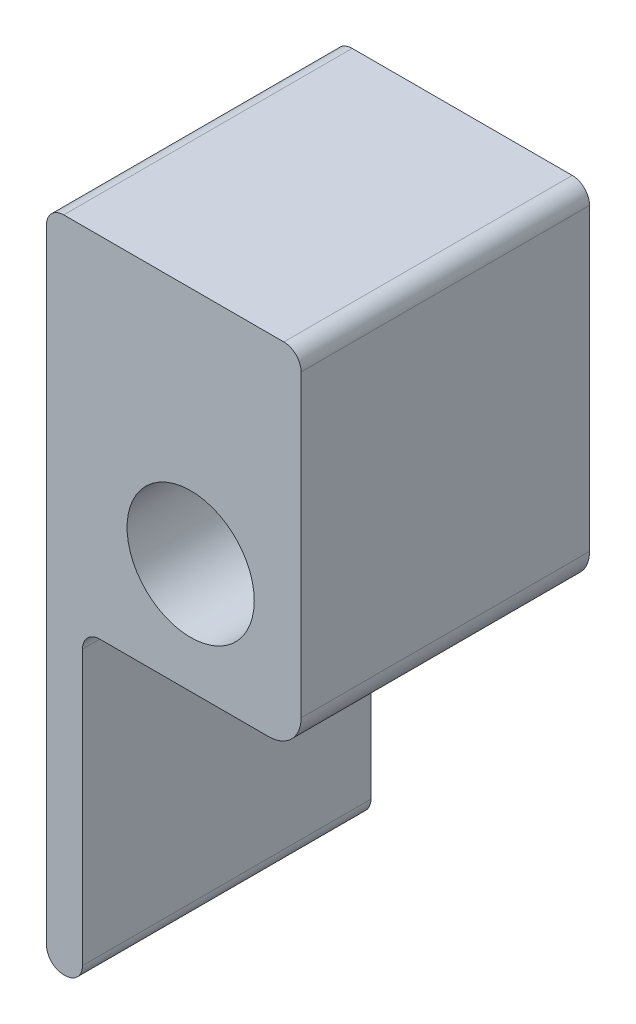
ISO-10303-21;
HEADER;
FILE_DESCRIPTION(('STEP AP214'),'2;1');
FILE_NAME('part.step','',(''),(''),'','','');
FILE_SCHEMA(('AUTOMOTIVE_DESIGN { 1 0 10303 214 1 1 1 1 }'));
ENDSEC;
DATA;
#1=APPLICATION_CONTEXT('core data for automotive mechanical design processes');
#2=APPLICATION_PROTOCOL_DEFINITION('international standard','automotive_design',2000,#1);
#3=PRODUCT_CONTEXT('',#1,'mechanical');
#4=PRODUCT('Part','Part','',(#3));
#5=PRODUCT_RELATED_PRODUCT_CATEGORY('part','',(#4));
#6=PRODUCT_DEFINITION_FORMATION('','',#4);
#7=PRODUCT_DEFINITION_CONTEXT('part definition',#1,'design');
#8=PRODUCT_DEFINITION('design','',#6,#7);
#9=PRODUCT_DEFINITION_SHAPE('','',#8);
#10=(LENGTH_UNIT() NAMED_UNIT(*) SI_UNIT(.MILLI.,.METRE.));
#11=(NAMED_UNIT(*) PLANE_ANGLE_UNIT() SI_UNIT($,.RADIAN.));
#12=(NAMED_UNIT(*) SI_UNIT($,.STERADIAN.) SOLID_ANGLE_UNIT());
#13=UNCERTAINTY_MEASURE_WITH_UNIT(LENGTH_MEASURE(1.E-05),#10,'distance_accuracy_value','');
#14=(GEOMETRIC_REPRESENTATION_CONTEXT(3) GLOBAL_UNCERTAINTY_ASSIGNED_CONTEXT((#13)) GLOBAL_UNIT_ASSIGNED_CONTEXT((#10,
#11,#12)) REPRESENTATION_CONTEXT('',''));
#15=CARTESIAN_POINT('',(0.,0.,0.));
#16=DIRECTION('',(0.,0.,1.));
#17=DIRECTION('',(1.,0.,0.));
#18=AXIS2_PLACEMENT_3D('',#15,#16,#17);
#19=CARTESIAN_POINT('',(-22.352,-70.781999962,50.8));
#20=DIRECTION('',(0.,0.,1.));
#21=DIRECTION('',(1.,0.,0.));
#22=AXIS2_PLACEMENT_3D('',#19,#20,#21);
#23=PLANE('',#22);
#24=DIRECTION('',(0.,-1.,0.));
#25=VECTOR('',#24,1.);
#26=CARTESIAN_POINT('',(-25.4,-19.455,50.8));
#27=LINE('',#26,#25);
#28=CARTESIAN_POINT('',(-25.4,39.031999962,50.8));
#29=VERTEX_POINT('',#28);
#30=CARTESIAN_POINT('',(-25.4,-70.781999962,50.8));
#31=VERTEX_POINT('',#30);
#32=EDGE_CURVE('E63',#29,#31,#27,.T.);
#33=ORIENTED_EDGE('',*,*,#32,.T.);
#34=CARTESIAN_POINT('',(-22.352,-70.781999962,50.8));
#35=DIRECTION('',(0.,0.,1.));
#36=DIRECTION('',(1.,0.,0.));
#37=AXIS2_PLACEMENT_3D('',#34,#35,#36);
#38=CIRCLE('',#37,3.048);
#39=CARTESIAN_POINT('',(-22.352,-73.829999962,50.8));
#40=VERTEX_POINT('',#39);
#41=EDGE_CURVE('E120',#31,#40,#38,.T.);
#42=ORIENTED_EDGE('',*,*,#41,.T.);
#43=DIRECTION('',(1.,0.,0.));
#44=VECTOR('',#43,1.);
#45=CARTESIAN_POINT('',(-22.352,-73.829999962,50.8));
#46=LINE('',#45,#44);
#47=CARTESIAN_POINT('',(-22.098,-73.829999962,50.8));
#48=VERTEX_POINT('',#47);
#49=EDGE_CURVE('E248',#40,#48,#46,.T.);
#50=ORIENTED_EDGE('',*,*,#49,.T.);
#51=CARTESIAN_POINT('',(-22.098,-70.781999962,50.8));
#52=DIRECTION('',(0.,0.,1.));
#53=DIRECTION('',(1.,0.,0.));
#54=AXIS2_PLACEMENT_3D('',#51,#52,#53);
#55=CIRCLE('',#54,3.048);
#56=CARTESIAN_POINT('',(-19.05,-70.781999962,50.8));
#57=VERTEX_POINT('',#56);
#58=EDGE_CURVE('E266',#48,#57,#55,.T.);
#59=ORIENTED_EDGE('',*,*,#58,.T.);
#60=DIRECTION('',(0.,1.,0.));
#61=VECTOR('',#60,1.);
#62=CARTESIAN_POINT('',(-19.05,-22.503,50.8));
#63=LINE('',#62,#61);
#64=CARTESIAN_POINT('',(-19.05,-22.503,50.8));
#65=VERTEX_POINT('',#64);
#66=EDGE_CURVE('E262',#57,#65,#63,.T.);
#67=ORIENTED_EDGE('',*,*,#66,.T.);
#68=CARTESIAN_POINT('',(-16.002,-22.503,50.8));
#69=DIRECTION('',(0.,0.,-1.));
#70=DIRECTION('',(1.,0.,0.));
#71=AXIS2_PLACEMENT_3D('',#68,#69,#70);
#72=CIRCLE('',#71,3.048);
#73=CARTESIAN_POINT('',(-16.002,-19.455,50.8));
#74=VERTEX_POINT('',#73);
#75=EDGE_CURVE('E265',#65,#74,#72,.T.);
#76=ORIENTED_EDGE('',*,*,#75,.T.);
#77=DIRECTION('',(1.,0.,0.));
#78=VECTOR('',#77,1.);
#79=CARTESIAN_POINT('',(-16.002,-19.455,50.8));
#80=LINE('',#79,#78);
#81=CARTESIAN_POINT('',(13.74,-19.455,50.8));
#82=VERTEX_POINT('',#81);
#83=EDGE_CURVE('E270',#74,#82,#80,.T.);
#84=ORIENTED_EDGE('',*,*,#83,.T.);
#85=CARTESIAN_POINT('',(13.74,-13.74,50.8));
#86=DIRECTION('',(0.,0.,1.));
#87=DIRECTION('',(-1.,0.,0.));
#88=AXIS2_PLACEMENT_3D('',#85,#86,#87);
#89=CIRCLE('',#88,5.715);
#90=CARTESIAN_POINT('',(19.455,-13.74,50.8));
#91=VERTEX_POINT('',#90);
#92=EDGE_CURVE('E277',#82,#91,#89,.T.);
#93=ORIENTED_EDGE('',*,*,#92,.T.);
#94=DIRECTION('',(0.,1.,0.));
#95=VECTOR('',#94,1.);
#96=CARTESIAN_POINT('',(19.455,0.,50.8));
#97=LINE('',#96,#95);
#98=CARTESIAN_POINT('',(19.455,39.031999962,50.8));
#99=VERTEX_POINT('',#98);
#100=EDGE_CURVE('E152',#91,#99,#97,.T.);
#101=ORIENTED_EDGE('',*,*,#100,.T.);
#102=CARTESIAN_POINT('',(16.407,39.031999962,50.8));
#103=DIRECTION('',(0.,0.,1.));
#104=DIRECTION('',(-1.,0.,0.));
#105=AXIS2_PLACEMENT_3D('',#102,#103,#104);
#106=CIRCLE('',#105,3.048);
#107=CARTESIAN_POINT('',(16.407,42.079999962,50.8));
#108=VERTEX_POINT('',#107);
#109=EDGE_CURVE('E146',#99,#108,#106,.T.);
#110=ORIENTED_EDGE('',*,*,#109,.T.);
#111=DIRECTION('',(-1.,0.,0.));
#112=VECTOR('',#111,1.);
#113=CARTESIAN_POINT('',(-22.352,42.079999962,50.8));
#114=LINE('',#113,#112);
#115=CARTESIAN_POINT('',(-22.352,42.079999962,50.8));
#116=VERTEX_POINT('',#115);
#117=EDGE_CURVE('E150',#108,#116,#114,.T.);
#118=ORIENTED_EDGE('',*,*,#117,.T.);
#119=CARTESIAN_POINT('',(-22.352,39.031999962,50.8));
#120=DIRECTION('',(0.,0.,1.));
#121=DIRECTION('',(-1.,0.,0.));
#122=AXIS2_PLACEMENT_3D('',#119,#120,#121);
#123=CIRCLE('',#122,3.048);
#124=EDGE_CURVE('E169',#116,#29,#123,.T.);
#125=ORIENTED_EDGE('',*,*,#124,.T.);
#126=EDGE_LOOP('',(#33,#42,#50,#59,#67,#76,#84,#93,#101,#110,#118,#125));
#127=FACE_BOUND('',#126,.T.);
#128=CARTESIAN_POINT('',(0.,0.,50.8));
#129=DIRECTION('',(0.,0.,1.));
#130=DIRECTION('',(1.,0.,0.));
#131=AXIS2_PLACEMENT_3D('',#128,#129,#130);
#132=CIRCLE('',#131,11.2);
#133=CARTESIAN_POINT('',(11.2,0.,50.8));
#134=VERTEX_POINT('',#133);
#135=EDGE_CURVE('E180',#134,#134,#132,.T.);
#136=ORIENTED_EDGE('',*,*,#135,.F.);
#137=EDGE_LOOP('',(#136));
#138=FACE_BOUND('',#137,.T.);
#139=ADVANCED_FACE('F45',(#127,#138),#23,.T.);
#140=CARTESIAN_POINT('',(-22.352,-70.781999962,0.));
#141=DIRECTION('',(0.,0.,1.));
#142=DIRECTION('',(1.,0.,0.));
#143=AXIS2_PLACEMENT_3D('',#140,#141,#142);
#144=PLANE('',#143);
#145=CARTESIAN_POINT('',(-22.352,-70.781999962,0.));
#146=DIRECTION('',(0.,0.,1.));
#147=DIRECTION('',(1.,0.,0.));
#148=AXIS2_PLACEMENT_3D('',#145,#146,#147);
#149=CIRCLE('',#148,3.048);
#150=CARTESIAN_POINT('',(-25.4,-70.781999962,0.));
#151=VERTEX_POINT('',#150);
#152=CARTESIAN_POINT('',(-22.352,-73.829999962,0.));
#153=VERTEX_POINT('',#152);
#154=EDGE_CURVE('E176',#151,#153,#149,.T.);
#155=ORIENTED_EDGE('',*,*,#154,.F.);
#156=DIRECTION('',(0.,-1.,0.));
#157=VECTOR('',#156,1.);
#158=CARTESIAN_POINT('',(-25.4,-19.455,0.));
#159=LINE('',#158,#157);
#160=CARTESIAN_POINT('',(-25.4,39.031999962,0.));
#161=VERTEX_POINT('',#160);
#162=EDGE_CURVE('E112',#161,#151,#159,.T.);
#163=ORIENTED_EDGE('',*,*,#162,.F.);
#164=CARTESIAN_POINT('',(-22.352,39.031999962,0.));
#165=DIRECTION('',(0.,0.,1.));
#166=DIRECTION('',(-1.,0.,0.));
#167=AXIS2_PLACEMENT_3D('',#164,#165,#166);
#168=CIRCLE('',#167,3.048);
#169=CARTESIAN_POINT('',(-22.352,42.079999962,0.));
#170=VERTEX_POINT('',#169);
#171=EDGE_CURVE('E207',#170,#161,#168,.T.);
#172=ORIENTED_EDGE('',*,*,#171,.F.);
#173=DIRECTION('',(-1.,0.,0.));
#174=VECTOR('',#173,1.);
#175=CARTESIAN_POINT('',(-22.352,42.079999962,0.));
#176=LINE('',#175,#174);
#177=CARTESIAN_POINT('',(16.407,42.079999962,0.));
#178=VERTEX_POINT('',#177);
#179=EDGE_CURVE('E105',#178,#170,#176,.T.);
#180=ORIENTED_EDGE('',*,*,#179,.F.);
#181=CARTESIAN_POINT('',(16.407,39.031999962,0.));
#182=DIRECTION('',(0.,0.,1.));
#183=DIRECTION('',(-1.,0.,0.));
#184=AXIS2_PLACEMENT_3D('',#181,#182,#183);
#185=CIRCLE('',#184,3.048);
#186=CARTESIAN_POINT('',(19.455,39.031999962,0.));
#187=VERTEX_POINT('',#186);
#188=EDGE_CURVE('E161',#187,#178,#185,.T.);
#189=ORIENTED_EDGE('',*,*,#188,.F.);
#190=DIRECTION('',(0.,1.,0.));
#191=VECTOR('',#190,1.);
#192=CARTESIAN_POINT('',(19.455,19.455,0.));
#193=LINE('',#192,#191);
#194=CARTESIAN_POINT('',(19.455,-13.74,0.));
#195=VERTEX_POINT('',#194);
#196=EDGE_CURVE('E200',#195,#187,#193,.T.);
#197=ORIENTED_EDGE('',*,*,#196,.F.);
#198=CARTESIAN_POINT('',(13.74,-13.74,0.));
#199=DIRECTION('',(0.,0.,1.));
#200=DIRECTION('',(-1.,0.,0.));
#201=AXIS2_PLACEMENT_3D('',#198,#199,#200);
#202=CIRCLE('',#201,5.715);
#203=CARTESIAN_POINT('',(13.74,-19.455,0.));
#204=VERTEX_POINT('',#203);
#205=EDGE_CURVE('E196',#204,#195,#202,.T.);
#206=ORIENTED_EDGE('',*,*,#205,.F.);
#207=DIRECTION('',(1.,0.,0.));
#208=VECTOR('',#207,1.);
#209=CARTESIAN_POINT('',(13.74,-19.455,0.));
#210=LINE('',#209,#208);
#211=CARTESIAN_POINT('',(-16.002,-19.455,0.));
#212=VERTEX_POINT('',#211);
#213=EDGE_CURVE('E193',#212,#204,#210,.T.);
#214=ORIENTED_EDGE('',*,*,#213,.F.);
#215=CARTESIAN_POINT('',(-16.002,-22.503,0.));
#216=DIRECTION('',(0.,0.,-1.));
#217=DIRECTION('',(1.,0.,0.));
#218=AXIS2_PLACEMENT_3D('',#215,#216,#217);
#219=CIRCLE('',#218,3.048);
#220=CARTESIAN_POINT('',(-19.05,-22.503,0.));
#221=VERTEX_POINT('',#220);
#222=EDGE_CURVE('E189',#221,#212,#219,.T.);
#223=ORIENTED_EDGE('',*,*,#222,.F.);
#224=DIRECTION('',(0.,1.,0.));
#225=VECTOR('',#224,1.);
#226=CARTESIAN_POINT('',(-19.05,-22.503,0.));
#227=LINE('',#226,#225);
#228=CARTESIAN_POINT('',(-19.05,-70.781999962,0.));
#229=VERTEX_POINT('',#228);
#230=EDGE_CURVE('E186',#229,#221,#227,.T.);
#231=ORIENTED_EDGE('',*,*,#230,.F.);
#232=CARTESIAN_POINT('',(-22.098,-70.781999962,0.));
#233=DIRECTION('',(0.,0.,1.));
#234=DIRECTION('',(1.,0.,0.));
#235=AXIS2_PLACEMENT_3D('',#232,#233,#234);
#236=CIRCLE('',#235,3.048);
#237=CARTESIAN_POINT('',(-22.098,-73.829999962,0.));
#238=VERTEX_POINT('',#237);
#239=EDGE_CURVE('E183',#238,#229,#236,.T.);
#240=ORIENTED_EDGE('',*,*,#239,.F.);
#241=DIRECTION('',(1.,0.,0.));
#242=VECTOR('',#241,1.);
#243=CARTESIAN_POINT('',(-22.352,-73.829999962,0.));
#244=LINE('',#243,#242);
#245=EDGE_CURVE('E179',#153,#238,#244,.T.);
#246=ORIENTED_EDGE('',*,*,#245,.F.);
#247=EDGE_LOOP('',(#155,#163,#172,#180,#189,#197,#206,#214,#223,#231,#240,#246));
#248=FACE_BOUND('',#247,.T.);
#249=CARTESIAN_POINT('',(0.,0.,0.));
#250=DIRECTION('',(0.,0.,1.));
#251=DIRECTION('',(1.,0.,0.));
#252=AXIS2_PLACEMENT_3D('',#249,#250,#251);
#253=CIRCLE('',#252,11.2);
#254=CARTESIAN_POINT('',(11.2,0.,0.));
#255=VERTEX_POINT('',#254);
#256=EDGE_CURVE('E437',#255,#255,#253,.T.);
#257=ORIENTED_EDGE('',*,*,#256,.T.);
#258=EDGE_LOOP('',(#257));
#259=FACE_BOUND('',#258,.T.);
#260=ADVANCED_FACE('F250',(#248,#259),#144,.F.);
#261=CARTESIAN_POINT('',(-22.352,-70.781999962,50.8));
#262=DIRECTION('',(0.,0.,-1.));
#263=DIRECTION('',(-1.,0.,0.));
#264=AXIS2_PLACEMENT_3D('',#261,#262,#263);
#265=CYLINDRICAL_SURFACE('',#264,3.048);
#266=ORIENTED_EDGE('',*,*,#154,.T.);
#267=DIRECTION('',(0.,0.,-1.));
#268=VECTOR('',#267,1.);
#269=CARTESIAN_POINT('',(-22.352,-73.829999962,50.8));
#270=LINE('',#269,#268);
#271=EDGE_CURVE('E55',#40,#153,#270,.T.);
#272=ORIENTED_EDGE('',*,*,#271,.F.);
#273=ORIENTED_EDGE('',*,*,#41,.F.);
#274=DIRECTION('',(0.,0.,-1.));
#275=VECTOR('',#274,1.);
#276=CARTESIAN_POINT('',(-25.4,-70.781999962,50.8));
#277=LINE('',#276,#275);
#278=EDGE_CURVE('E11',#31,#151,#277,.T.);
#279=ORIENTED_EDGE('',*,*,#278,.T.);
#280=EDGE_LOOP('',(#266,#272,#273,#279));
#281=FACE_BOUND('',#280,.T.);
#282=ADVANCED_FACE('F47',(#281),#265,.T.);
#283=CARTESIAN_POINT('',(-22.352,-73.829999962,50.8));
#284=DIRECTION('',(0.,1.,0.));
#285=DIRECTION('',(-1.,0.,0.));
#286=AXIS2_PLACEMENT_3D('',#283,#284,#285);
#287=PLANE('',#286);
#288=ORIENTED_EDGE('',*,*,#245,.T.);
#289=DIRECTION('',(0.,0.,-1.));
#290=VECTOR('',#289,1.);
#291=CARTESIAN_POINT('',(-22.098,-73.829999962,50.8));
#292=LINE('',#291,#290);
#293=EDGE_CURVE('E238',#48,#238,#292,.T.);
#294=ORIENTED_EDGE('',*,*,#293,.F.);
#295=ORIENTED_EDGE('',*,*,#49,.F.);
#296=ORIENTED_EDGE('',*,*,#271,.T.);
#297=EDGE_LOOP('',(#288,#294,#295,#296));
#298=FACE_BOUND('',#297,.T.);
#299=ADVANCED_FACE('F246',(#298),#287,.F.);
#300=CARTESIAN_POINT('',(-22.098,-70.781999962,50.8));
#301=DIRECTION('',(0.,0.,-1.));
#302=DIRECTION('',(-1.,0.,0.));
#303=AXIS2_PLACEMENT_3D('',#300,#301,#302);
#304=CYLINDRICAL_SURFACE('',#303,3.048);
#305=ORIENTED_EDGE('',*,*,#239,.T.);
#306=DIRECTION('',(0.,0.,-1.));
#307=VECTOR('',#306,1.);
#308=CARTESIAN_POINT('',(-19.05,-70.781999962,50.8));
#309=LINE('',#308,#307);
#310=EDGE_CURVE('E234',#57,#229,#309,.T.);
#311=ORIENTED_EDGE('',*,*,#310,.F.);
#312=ORIENTED_EDGE('',*,*,#58,.F.);
#313=ORIENTED_EDGE('',*,*,#293,.T.);
#314=EDGE_LOOP('',(#305,#311,#312,#313));
#315=FACE_BOUND('',#314,.T.);
#316=ADVANCED_FACE('F256',(#315),#304,.T.);
#317=CARTESIAN_POINT('',(-19.05,-22.503,50.8));
#318=DIRECTION('',(-1.,0.,0.));
#319=DIRECTION('',(0.,-1.,0.));
#320=AXIS2_PLACEMENT_3D('',#317,#318,#319);
#321=PLANE('',#320);
#322=ORIENTED_EDGE('',*,*,#230,.T.);
#323=DIRECTION('',(0.,0.,-1.));
#324=VECTOR('',#323,1.);
#325=CARTESIAN_POINT('',(-19.05,-22.503,50.8));
#326=LINE('',#325,#324);
#327=EDGE_CURVE('E230',#65,#221,#326,.T.);
#328=ORIENTED_EDGE('',*,*,#327,.F.);
#329=ORIENTED_EDGE('',*,*,#66,.F.);
#330=ORIENTED_EDGE('',*,*,#310,.T.);
#331=EDGE_LOOP('',(#322,#328,#329,#330));
#332=FACE_BOUND('',#331,.T.);
#333=ADVANCED_FACE('F260',(#332),#321,.F.);
#334=CARTESIAN_POINT('',(-16.002,-22.503,50.8));
#335=DIRECTION('',(0.,0.,-1.));
#336=DIRECTION('',(-1.,0.,0.));
#337=AXIS2_PLACEMENT_3D('',#334,#335,#336);
#338=CYLINDRICAL_SURFACE('',#337,3.048);
#339=ORIENTED_EDGE('',*,*,#222,.T.);
#340=DIRECTION('',(0.,0.,-1.));
#341=VECTOR('',#340,1.);
#342=CARTESIAN_POINT('',(-16.002,-19.455,50.8));
#343=LINE('',#342,#341);
#344=EDGE_CURVE('E226',#74,#212,#343,.T.);
#345=ORIENTED_EDGE('',*,*,#344,.F.);
#346=ORIENTED_EDGE('',*,*,#75,.F.);
#347=ORIENTED_EDGE('',*,*,#327,.T.);
#348=EDGE_LOOP('',(#339,#345,#346,#347));
#349=FACE_BOUND('',#348,.T.);
#350=ADVANCED_FACE('F321',(#349),#338,.F.);
#351=CARTESIAN_POINT('',(13.74,-19.455,50.8));
#352=DIRECTION('',(0.,1.,0.));
#353=DIRECTION('',(-1.,0.,0.));
#354=AXIS2_PLACEMENT_3D('',#351,#352,#353);
#355=PLANE('',#354);
#356=ORIENTED_EDGE('',*,*,#213,.T.);
#357=DIRECTION('',(0.,0.,-1.));
#358=VECTOR('',#357,1.);
#359=CARTESIAN_POINT('',(13.74,-19.455,50.8));
#360=LINE('',#359,#358);
#361=EDGE_CURVE('E222',#82,#204,#360,.T.);
#362=ORIENTED_EDGE('',*,*,#361,.F.);
#363=ORIENTED_EDGE('',*,*,#83,.F.);
#364=ORIENTED_EDGE('',*,*,#344,.T.);
#365=EDGE_LOOP('',(#356,#362,#363,#364));
#366=FACE_BOUND('',#365,.T.);
#367=ADVANCED_FACE('F318',(#366),#355,.F.);
#368=CARTESIAN_POINT('',(13.74,-13.74,50.8));
#369=DIRECTION('',(0.,0.,-1.));
#370=DIRECTION('',(-1.,0.,0.));
#371=AXIS2_PLACEMENT_3D('',#368,#369,#370);
#372=CYLINDRICAL_SURFACE('',#371,5.715);
#373=ORIENTED_EDGE('',*,*,#205,.T.);
#374=DIRECTION('',(0.,0.,-1.));
#375=VECTOR('',#374,1.);
#376=CARTESIAN_POINT('',(19.455,-13.74,50.8));
#377=LINE('',#376,#375);
#378=EDGE_CURVE('E218',#91,#195,#377,.T.);
#379=ORIENTED_EDGE('',*,*,#378,.F.);
#380=ORIENTED_EDGE('',*,*,#92,.F.);
#381=ORIENTED_EDGE('',*,*,#361,.T.);
#382=EDGE_LOOP('',(#373,#379,#380,#381));
#383=FACE_BOUND('',#382,.T.);
#384=ADVANCED_FACE('F285',(#383),#372,.T.);
#385=CARTESIAN_POINT('',(19.455,19.455,50.8));
#386=DIRECTION('',(-1.,0.,0.));
#387=DIRECTION('',(0.,-1.,0.));
#388=AXIS2_PLACEMENT_3D('',#385,#386,#387);
#389=PLANE('',#388);
#390=ORIENTED_EDGE('',*,*,#196,.T.);
#391=DIRECTION('',(0.,0.,-1.));
#392=VECTOR('',#391,1.);
#393=CARTESIAN_POINT('',(19.455,39.031999962,50.8));
#394=LINE('',#393,#392);
#395=EDGE_CURVE('E163',#99,#187,#394,.T.);
#396=ORIENTED_EDGE('',*,*,#395,.F.);
#397=ORIENTED_EDGE('',*,*,#100,.F.);
#398=ORIENTED_EDGE('',*,*,#378,.T.);
#399=EDGE_LOOP('',(#390,#396,#397,#398));
#400=FACE_BOUND('',#399,.T.);
#401=ADVANCED_FACE('F288',(#400),#389,.F.);
#402=CARTESIAN_POINT('',(16.407,39.031999962,50.8));
#403=DIRECTION('',(0.,0.,-1.));
#404=DIRECTION('',(-1.,0.,0.));
#405=AXIS2_PLACEMENT_3D('',#402,#403,#404);
#406=CYLINDRICAL_SURFACE('',#405,3.048);
#407=ORIENTED_EDGE('',*,*,#188,.T.);
#408=DIRECTION('',(0.,0.,-1.));
#409=VECTOR('',#408,1.);
#410=CARTESIAN_POINT('',(16.407,42.079999962,50.8));
#411=LINE('',#410,#409);
#412=EDGE_CURVE('E158',#108,#178,#411,.T.);
#413=ORIENTED_EDGE('',*,*,#412,.F.);
#414=ORIENTED_EDGE('',*,*,#109,.F.);
#415=ORIENTED_EDGE('',*,*,#395,.T.);
#416=EDGE_LOOP('',(#407,#413,#414,#415));
#417=FACE_BOUND('',#416,.T.);
#418=ADVANCED_FACE('F159',(#417),#406,.T.);
#419=CARTESIAN_POINT('',(-22.352,42.079999962,50.8));
#420=DIRECTION('',(0.,-1.,0.));
#421=DIRECTION('',(0.,0.,-1.));
#422=AXIS2_PLACEMENT_3D('',#419,#420,#421);
#423=PLANE('',#422);
#424=ORIENTED_EDGE('',*,*,#179,.T.);
#425=DIRECTION('',(0.,0.,-1.));
#426=VECTOR('',#425,1.);
#427=CARTESIAN_POINT('',(-22.352,42.079999962,50.8));
#428=LINE('',#427,#426);
#429=EDGE_CURVE('E164',#116,#170,#428,.T.);
#430=ORIENTED_EDGE('',*,*,#429,.F.);
#431=ORIENTED_EDGE('',*,*,#117,.F.);
#432=ORIENTED_EDGE('',*,*,#412,.T.);
#433=EDGE_LOOP('',(#424,#430,#431,#432));
#434=FACE_BOUND('',#433,.T.);
#435=ADVANCED_FACE('F166',(#434),#423,.F.);
#436=CARTESIAN_POINT('',(-22.352,39.031999962,50.8));
#437=DIRECTION('',(0.,0.,-1.));
#438=DIRECTION('',(-1.,0.,0.));
#439=AXIS2_PLACEMENT_3D('',#436,#437,#438);
#440=CYLINDRICAL_SURFACE('',#439,3.048);
#441=ORIENTED_EDGE('',*,*,#171,.T.);
#442=DIRECTION('',(0.,0.,-1.));
#443=VECTOR('',#442,1.);
#444=CARTESIAN_POINT('',(-25.4,39.031999962,50.8));
#445=LINE('',#444,#443);
#446=EDGE_CURVE('E172',#29,#161,#445,.T.);
#447=ORIENTED_EDGE('',*,*,#446,.F.);
#448=ORIENTED_EDGE('',*,*,#124,.F.);
#449=ORIENTED_EDGE('',*,*,#429,.T.);
#450=EDGE_LOOP('',(#441,#447,#448,#449));
#451=FACE_BOUND('',#450,.T.);
#452=ADVANCED_FACE('F291',(#451),#440,.T.);
#453=CARTESIAN_POINT('',(-25.4,-19.455,50.8));
#454=DIRECTION('',(1.,0.,0.));
#455=DIRECTION('',(0.,0.,-1.));
#456=AXIS2_PLACEMENT_3D('',#453,#454,#455);
#457=PLANE('',#456);
#458=ORIENTED_EDGE('',*,*,#162,.T.);
#459=ORIENTED_EDGE('',*,*,#278,.F.);
#460=ORIENTED_EDGE('',*,*,#32,.F.);
#461=ORIENTED_EDGE('',*,*,#446,.T.);
#462=EDGE_LOOP('',(#458,#459,#460,#461));
#463=FACE_BOUND('',#462,.T.);
#464=ADVANCED_FACE('F292',(#463),#457,.F.);
#465=CARTESIAN_POINT('',(0.,0.,50.8));
#466=DIRECTION('',(0.,0.,-1.));
#467=DIRECTION('',(-1.,0.,0.));
#468=AXIS2_PLACEMENT_3D('',#465,#466,#467);
#469=CYLINDRICAL_SURFACE('',#468,11.2);
#470=ORIENTED_EDGE('',*,*,#135,.T.);
#471=EDGE_LOOP('',(#470));
#472=FACE_BOUND('',#471,.T.);
#473=ORIENTED_EDGE('',*,*,#256,.F.);
#474=EDGE_LOOP('',(#473));
#475=FACE_BOUND('',#474,.T.);
#476=ADVANCED_FACE('F304',(#472,#475),#469,.F.);
#477=CLOSED_SHELL('',(#139,#260,#282,#299,#316,#333,#350,#367,#384,#401,#418,#435,#452,#464,#476));
#478=MANIFOLD_SOLID_BREP('B2',#477);
#479=ADVANCED_BREP_SHAPE_REPRESENTATION('',(#18,#478),#14);
#480=SHAPE_DEFINITION_REPRESENTATION(#9,#479);
ENDSEC;
END-ISO-10303-21;
